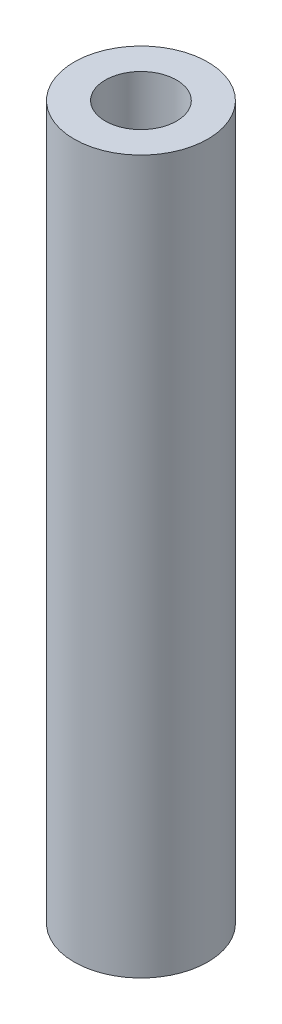
ISO-10303-21;
HEADER;
FILE_DESCRIPTION(('STEP AP214'),'2;1');
FILE_NAME('part.step','',(''),(''),'','','');
FILE_SCHEMA(('AUTOMOTIVE_DESIGN { 1 0 10303 214 1 1 1 1 }'));
ENDSEC;
DATA;
#1=APPLICATION_CONTEXT('core data for automotive mechanical design processes');
#2=APPLICATION_PROTOCOL_DEFINITION('international standard','automotive_design',2000,#1);
#3=PRODUCT_CONTEXT('',#1,'mechanical');
#4=PRODUCT('Part','Part','',(#3));
#5=PRODUCT_RELATED_PRODUCT_CATEGORY('part','',(#4));
#6=PRODUCT_DEFINITION_FORMATION('','',#4);
#7=PRODUCT_DEFINITION_CONTEXT('part definition',#1,'design');
#8=PRODUCT_DEFINITION('design','',#6,#7);
#9=PRODUCT_DEFINITION_SHAPE('','',#8);
#10=(LENGTH_UNIT() NAMED_UNIT(*) SI_UNIT(.MILLI.,.METRE.));
#11=(NAMED_UNIT(*) PLANE_ANGLE_UNIT() SI_UNIT($,.RADIAN.));
#12=(NAMED_UNIT(*) SI_UNIT($,.STERADIAN.) SOLID_ANGLE_UNIT());
#13=UNCERTAINTY_MEASURE_WITH_UNIT(LENGTH_MEASURE(1.E-05),#10,'distance_accuracy_value','');
#14=(GEOMETRIC_REPRESENTATION_CONTEXT(3) GLOBAL_UNCERTAINTY_ASSIGNED_CONTEXT((#13)) GLOBAL_UNIT_ASSIGNED_CONTEXT((#10,
#11,#12)) REPRESENTATION_CONTEXT('',''));
#15=CARTESIAN_POINT('',(0.,0.,0.));
#16=DIRECTION('',(0.,0.,1.));
#17=DIRECTION('',(1.,0.,0.));
#18=AXIS2_PLACEMENT_3D('',#15,#16,#17);
#19=CARTESIAN_POINT('',(0.,101.6,0.));
#20=DIRECTION('',(0.,-1.,0.));
#21=DIRECTION('',(0.,0.,-1.));
#22=AXIS2_PLACEMENT_3D('',#19,#20,#21);
#23=CYLINDRICAL_SURFACE('',#22,9.525);
#24=CARTESIAN_POINT('',(0.,101.6,0.));
#25=DIRECTION('',(0.,1.,0.));
#26=DIRECTION('',(0.,0.,1.));
#27=AXIS2_PLACEMENT_3D('',#24,#25,#26);
#28=CIRCLE('',#27,9.525);
#29=CARTESIAN_POINT('',(0.,101.6,9.525));
#30=VERTEX_POINT('',#29);
#31=EDGE_CURVE('E10',#30,#30,#28,.T.);
#32=ORIENTED_EDGE('',*,*,#31,.F.);
#33=EDGE_LOOP('',(#32));
#34=FACE_BOUND('',#33,.T.);
#35=CARTESIAN_POINT('',(0.,0.,0.));
#36=DIRECTION('',(0.,1.,0.));
#37=DIRECTION('',(0.,0.,1.));
#38=AXIS2_PLACEMENT_3D('',#35,#36,#37);
#39=CIRCLE('',#38,9.525);
#40=CARTESIAN_POINT('',(0.,0.,9.525));
#41=VERTEX_POINT('',#40);
#42=EDGE_CURVE('E39',#41,#41,#39,.T.);
#43=ORIENTED_EDGE('',*,*,#42,.T.);
#44=EDGE_LOOP('',(#43));
#45=FACE_BOUND('',#44,.T.);
#46=ADVANCED_FACE('F36',(#34,#45),#23,.T.);
#47=CARTESIAN_POINT('',(0.,101.6,0.));
#48=DIRECTION('',(0.,1.,0.));
#49=DIRECTION('',(0.,0.,1.));
#50=AXIS2_PLACEMENT_3D('',#47,#48,#49);
#51=PLANE('',#50);
#52=CARTESIAN_POINT('',(0.,101.6,0.));
#53=DIRECTION('',(0.,1.,0.));
#54=DIRECTION('',(0.,0.,1.));
#55=AXIS2_PLACEMENT_3D('',#52,#53,#54);
#56=CIRCLE('',#55,5.08);
#57=CARTESIAN_POINT('',(0.,101.6,5.08));
#58=VERTEX_POINT('',#57);
#59=EDGE_CURVE('E51',#58,#58,#56,.T.);
#60=ORIENTED_EDGE('',*,*,#59,.F.);
#61=EDGE_LOOP('',(#60));
#62=FACE_BOUND('',#61,.T.);
#63=ORIENTED_EDGE('',*,*,#31,.T.);
#64=EDGE_LOOP('',(#63));
#65=FACE_BOUND('',#64,.T.);
#66=ADVANCED_FACE('F69',(#62,#65),#51,.T.);
#67=CARTESIAN_POINT('',(0.,0.,0.));
#68=DIRECTION('',(0.,1.,0.));
#69=DIRECTION('',(0.,0.,1.));
#70=AXIS2_PLACEMENT_3D('',#67,#68,#69);
#71=PLANE('',#70);
#72=CARTESIAN_POINT('',(0.,0.,0.));
#73=DIRECTION('',(0.,1.,0.));
#74=DIRECTION('',(0.,0.,1.));
#75=AXIS2_PLACEMENT_3D('',#72,#73,#74);
#76=CIRCLE('',#75,5.08);
#77=CARTESIAN_POINT('',(0.,0.,5.08));
#78=VERTEX_POINT('',#77);
#79=EDGE_CURVE('E49',#78,#78,#76,.T.);
#80=ORIENTED_EDGE('',*,*,#79,.T.);
#81=EDGE_LOOP('',(#80));
#82=FACE_BOUND('',#81,.T.);
#83=ORIENTED_EDGE('',*,*,#42,.F.);
#84=EDGE_LOOP('',(#83));
#85=FACE_BOUND('',#84,.T.);
#86=ADVANCED_FACE('F60',(#82,#85),#71,.F.);
#87=CARTESIAN_POINT('',(0.,0.,0.));
#88=DIRECTION('',(0.,1.,0.));
#89=DIRECTION('',(0.,0.,1.));
#90=AXIS2_PLACEMENT_3D('',#87,#88,#89);
#91=CYLINDRICAL_SURFACE('',#90,5.08);
#92=ORIENTED_EDGE('',*,*,#79,.F.);
#93=EDGE_LOOP('',(#92));
#94=FACE_BOUND('',#93,.T.);
#95=ORIENTED_EDGE('',*,*,#59,.T.);
#96=EDGE_LOOP('',(#95));
#97=FACE_BOUND('',#96,.T.);
#98=ADVANCED_FACE('F63',(#94,#97),#91,.F.);
#99=CLOSED_SHELL('',(#46,#66,#86,#98));
#100=MANIFOLD_SOLID_BREP('B2',#99);
#101=ADVANCED_BREP_SHAPE_REPRESENTATION('',(#18,#100),#14);
#102=SHAPE_DEFINITION_REPRESENTATION(#9,#101);
ENDSEC;
END-ISO-10303-21;
